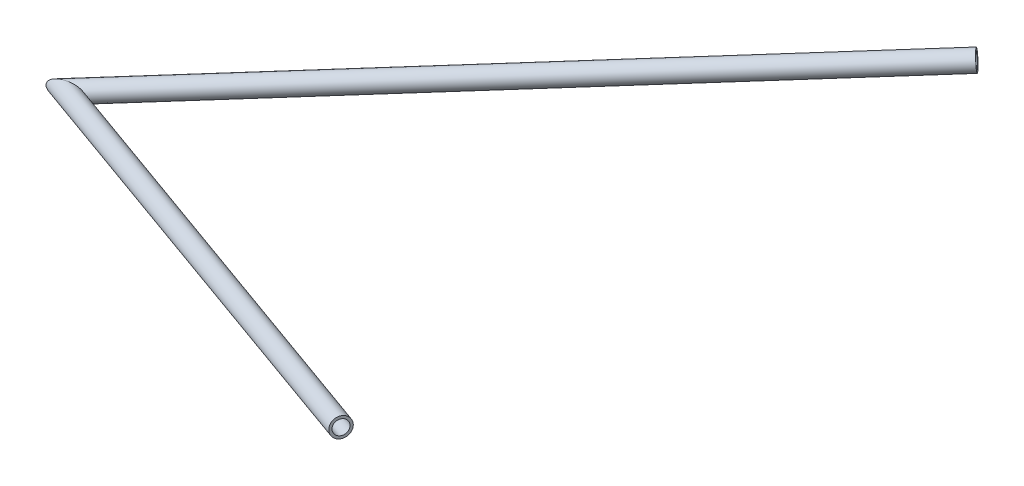
ISO-10303-21;
HEADER;
FILE_DESCRIPTION(('STEP AP214'),'2;1');
FILE_NAME('part.step','',(''),(''),'','','');
FILE_SCHEMA(('AUTOMOTIVE_DESIGN { 1 0 10303 214 1 1 1 1 }'));
ENDSEC;
DATA;
#1=APPLICATION_CONTEXT('core data for automotive mechanical design processes');
#2=APPLICATION_PROTOCOL_DEFINITION('international standard','automotive_design',2000,#1);
#3=PRODUCT_CONTEXT('',#1,'mechanical');
#4=PRODUCT('Part','Part','',(#3));
#5=PRODUCT_RELATED_PRODUCT_CATEGORY('part','',(#4));
#6=PRODUCT_DEFINITION_FORMATION('','',#4);
#7=PRODUCT_DEFINITION_CONTEXT('part definition',#1,'design');
#8=PRODUCT_DEFINITION('design','',#6,#7);
#9=PRODUCT_DEFINITION_SHAPE('','',#8);
#10=(LENGTH_UNIT() NAMED_UNIT(*) SI_UNIT(.MILLI.,.METRE.));
#11=(NAMED_UNIT(*) PLANE_ANGLE_UNIT() SI_UNIT($,.RADIAN.));
#12=(NAMED_UNIT(*) SI_UNIT($,.STERADIAN.) SOLID_ANGLE_UNIT());
#13=UNCERTAINTY_MEASURE_WITH_UNIT(LENGTH_MEASURE(1.E-05),#10,'distance_accuracy_value','');
#14=(GEOMETRIC_REPRESENTATION_CONTEXT(3) GLOBAL_UNCERTAINTY_ASSIGNED_CONTEXT((#13)) GLOBAL_UNIT_ASSIGNED_CONTEXT((#10,
#11,#12)) REPRESENTATION_CONTEXT('',''));
#15=CARTESIAN_POINT('',(0.,0.,0.));
#16=DIRECTION('',(0.,0.,1.));
#17=DIRECTION('',(1.,0.,0.));
#18=AXIS2_PLACEMENT_3D('',#15,#16,#17);
#19=CARTESIAN_POINT('',(-52.0000000000003,-175.4,0.));
#20=DIRECTION('',(0.916236374249616,0.0955745540284936,0.389071216005723));
#21=DIRECTION('',(0.390860467926581,0.,-0.920449941393998));
#22=AXIS2_PLACEMENT_3D('',#19,#20,#21);
#23=CYLINDRICAL_SURFACE('',#22,6.985);
#24=CARTESIAN_POINT('',(435.,-124.600000000004,206.799999999963));
#25=DIRECTION('',(-0.916236374249616,-0.0955745540284936,-0.389071216005723));
#26=DIRECTION('',(-0.393256806295087,0.0289913832751886,0.918971481602329));
#27=AXIS2_PLACEMENT_3D('',#24,#25,#26);
#28=CIRCLE('',#27,6.985);
#29=CARTESIAN_POINT('',(432.253101208029,-124.397495187827,213.219015798956));
#30=VERTEX_POINT('',#29);
#31=EDGE_CURVE('E66',#30,#30,#28,.T.);
#32=ORIENTED_EDGE('',*,*,#31,.F.);
#33=EDGE_LOOP('',(#32));
#34=FACE_BOUND('',#33,.T.);
#35=CARTESIAN_POINT('',(-52.0000000000003,-175.4,0.));
#36=DIRECTION('',(-0.165079115085724,-0.0172197516352238,-0.986129994430823));
#37=DIRECTION('',(0.980808335282266,0.102310191852843,-0.165974799544583));
#38=AXIS2_PLACEMENT_3D('',#35,#36,#37);
#39=ELLIPSE('',#38,13.017822902906,6.985);
#40=CARTESIAN_POINT('',(-39.2320107896017,-174.068144041297,-2.1606305468167));
#41=VERTEX_POINT('',#40);
#42=EDGE_CURVE('E62',#41,#41,#39,.T.);
#43=ORIENTED_EDGE('',*,*,#42,.T.);
#44=EDGE_LOOP('',(#43));
#45=FACE_BOUND('',#44,.T.);
#46=ADVANCED_FACE('F58',(#34,#45),#23,.F.);
#47=CARTESIAN_POINT('',(-52.0000000000003,-175.4,0.));
#48=DIRECTION('',(0.916236374249616,0.0955745540284936,0.389071216005723));
#49=DIRECTION('',(0.390860467926581,0.,-0.920449941393998));
#50=AXIS2_PLACEMENT_3D('',#47,#48,#49);
#51=CYLINDRICAL_SURFACE('',#50,9.525);
#52=CARTESIAN_POINT('',(435.,-124.600000000004,206.799999999963));
#53=DIRECTION('',(-0.916236374249616,-0.0955745540284936,-0.389071216005723));
#54=DIRECTION('',(-0.393256806295087,0.0289913832751886,0.918971481602329));
#55=AXIS2_PLACEMENT_3D('',#52,#53,#54);
#56=CIRCLE('',#55,9.525);
#57=CARTESIAN_POINT('',(431.254228920039,-124.323857074308,215.553203362226));
#58=VERTEX_POINT('',#57);
#59=EDGE_CURVE('E70',#58,#58,#56,.T.);
#60=ORIENTED_EDGE('',*,*,#59,.T.);
#61=EDGE_LOOP('',(#60));
#62=FACE_BOUND('',#61,.T.);
#63=CARTESIAN_POINT('',(-52.0000000000003,-175.4,0.));
#64=DIRECTION('',(-0.165079115085724,-0.0172197516352238,-0.986129994430823));
#65=DIRECTION('',(0.980808335282266,0.102310191852843,-0.165974799544583));
#66=AXIS2_PLACEMENT_3D('',#63,#64,#65);
#67=ELLIPSE('',#66,17.7515766857809,9.525);
#68=CARTESIAN_POINT('',(-34.589105622184,-173.583832783587,-2.94631438202277));
#69=VERTEX_POINT('',#68);
#70=EDGE_CURVE('E12',#69,#69,#67,.T.);
#71=ORIENTED_EDGE('',*,*,#70,.F.);
#72=EDGE_LOOP('',(#71));
#73=FACE_BOUND('',#72,.T.);
#74=ADVANCED_FACE('F85',(#62,#73),#51,.T.);
#75=CARTESIAN_POINT('',(435.,-124.600000000004,206.799999999963));
#76=DIRECTION('',(-0.916236374249616,-0.0955745540284936,-0.389071216005723));
#77=DIRECTION('',(-0.393256806295087,0.0289913832751886,0.918971481602329));
#78=AXIS2_PLACEMENT_3D('',#75,#76,#77);
#79=PLANE('',#78);
#80=ORIENTED_EDGE('',*,*,#31,.T.);
#81=EDGE_LOOP('',(#80));
#82=FACE_BOUND('',#81,.T.);
#83=ORIENTED_EDGE('',*,*,#59,.F.);
#84=EDGE_LOOP('',(#83));
#85=FACE_BOUND('',#84,.T.);
#86=ADVANCED_FACE('F81',(#82,#85),#79,.F.);
#87=CARTESIAN_POINT('',(-52.0000000000003,-175.4,0.));
#88=DIRECTION('',(-0.165079115085724,-0.0172197516352238,-0.986129994430823));
#89=DIRECTION('',(-0.986276230510281,0.,0.165103595146899));
#90=AXIS2_PLACEMENT_3D('',#87,#88,#89);
#91=PLANE('',#90);
#92=ORIENTED_EDGE('',*,*,#42,.F.);
#93=EDGE_LOOP('',(#92));
#94=FACE_BOUND('',#93,.T.);
#95=ORIENTED_EDGE('',*,*,#70,.T.);
#96=EDGE_LOOP('',(#95));
#97=FACE_BOUND('',#96,.T.);
#98=ADVANCED_FACE('F60',(#94,#97),#91,.T.);
#99=CLOSED_SHELL('',(#46,#74,#86,#98));
#100=MANIFOLD_SOLID_BREP('B2',#99);
#101=CARTESIAN_POINT('',(435.,-124.600000000004,-440.944896104356));
#102=DIRECTION('',(-0.739082693872481,-0.0770952789501411,0.669188381236403));
#103=DIRECTION('',(0.67118601210253,0.,0.741288970077056));
#104=AXIS2_PLACEMENT_3D('',#101,#102,#103);
#105=CYLINDRICAL_SURFACE('',#104,6.985);
#106=CARTESIAN_POINT('',(435.,-124.600000000004,-440.944896104356));
#107=DIRECTION('',(0.739082693872481,0.0770952789501411,-0.669188381236403));
#108=DIRECTION('',(-0.67118601210253,0.,-0.741288970077056));
#109=AXIS2_PLACEMENT_3D('',#106,#107,#108);
#110=CIRCLE('',#109,6.985);
#111=CARTESIAN_POINT('',(430.311765705464,-124.600000000004,-446.122799560344));
#112=VERTEX_POINT('',#111);
#113=EDGE_CURVE('E165',#112,#112,#110,.T.);
#114=ORIENTED_EDGE('',*,*,#113,.T.);
#115=EDGE_LOOP('',(#114));
#116=FACE_BOUND('',#115,.T.);
#117=CARTESIAN_POINT('',(-52.0000000000003,-175.4,0.));
#118=DIRECTION('',(0.165079115085724,0.0172197516352238,0.986129994430823));
#119=DIRECTION('',(-0.980808335282266,-0.102310191852843,0.165974799544583));
#120=AXIS2_PLACEMENT_3D('',#117,#118,#119);
#121=ELLIPSE('',#120,13.017822902906,6.985);
#122=CARTESIAN_POINT('',(-64.7679892103989,-176.731855958702,2.1606305468167));
#123=VERTEX_POINT('',#122);
#124=EDGE_CURVE('E153',#123,#123,#121,.T.);
#125=ORIENTED_EDGE('',*,*,#124,.T.);
#126=EDGE_LOOP('',(#125));
#127=FACE_BOUND('',#126,.T.);
#128=ADVANCED_FACE('F149',(#116,#127),#105,.F.);
#129=CARTESIAN_POINT('',(435.,-124.600000000004,-440.944896104356));
#130=DIRECTION('',(-0.739082693872481,-0.0770952789501411,0.669188381236403));
#131=DIRECTION('',(0.67118601210253,0.,0.741288970077056));
#132=AXIS2_PLACEMENT_3D('',#129,#130,#131);
#133=CYLINDRICAL_SURFACE('',#132,9.525);
#134=CARTESIAN_POINT('',(435.,-124.600000000004,-440.944896104356));
#135=DIRECTION('',(0.739082693872481,0.0770952789501411,-0.669188381236403));
#136=DIRECTION('',(-0.67118601210253,0.,-0.741288970077056));
#137=AXIS2_PLACEMENT_3D('',#134,#135,#136);
#138=CIRCLE('',#137,9.525);
#139=CARTESIAN_POINT('',(428.606953234723,-124.600000000004,-448.005673544339));
#140=VERTEX_POINT('',#139);
#141=EDGE_CURVE('E158',#140,#140,#138,.T.);
#142=ORIENTED_EDGE('',*,*,#141,.F.);
#143=EDGE_LOOP('',(#142));
#144=FACE_BOUND('',#143,.T.);
#145=CARTESIAN_POINT('',(-52.0000000000003,-175.4,0.));
#146=DIRECTION('',(0.165079115085724,0.0172197516352238,0.986129994430823));
#147=DIRECTION('',(-0.980808335282266,-0.102310191852843,0.165974799544583));
#148=AXIS2_PLACEMENT_3D('',#145,#146,#147);
#149=ELLIPSE('',#148,17.7515766857809,9.525);
#150=CARTESIAN_POINT('',(-69.4108943778166,-177.216167216412,2.94631438202277));
#151=VERTEX_POINT('',#150);
#152=EDGE_CURVE('E57',#151,#151,#149,.T.);
#153=ORIENTED_EDGE('',*,*,#152,.F.);
#154=EDGE_LOOP('',(#153));
#155=FACE_BOUND('',#154,.T.);
#156=ADVANCED_FACE('F180',(#144,#155),#133,.T.);
#157=CARTESIAN_POINT('',(435.,-124.600000000004,-440.944896104356));
#158=DIRECTION('',(0.739082693872481,0.0770952789501411,-0.669188381236403));
#159=DIRECTION('',(-0.67118601210253,0.,-0.741288970077056));
#160=AXIS2_PLACEMENT_3D('',#157,#158,#159);
#161=PLANE('',#160);
#162=ORIENTED_EDGE('',*,*,#113,.F.);
#163=EDGE_LOOP('',(#162));
#164=FACE_BOUND('',#163,.T.);
#165=ORIENTED_EDGE('',*,*,#141,.T.);
#166=EDGE_LOOP('',(#165));
#167=FACE_BOUND('',#166,.T.);
#168=ADVANCED_FACE('F176',(#164,#167),#161,.T.);
#169=CARTESIAN_POINT('',(-52.0000000000003,-175.4,0.));
#170=DIRECTION('',(0.165079115085724,0.0172197516352238,0.986129994430823));
#171=DIRECTION('',(0.986276230510281,0.,-0.165103595146899));
#172=AXIS2_PLACEMENT_3D('',#169,#170,#171);
#173=PLANE('',#172);
#174=ORIENTED_EDGE('',*,*,#124,.F.);
#175=EDGE_LOOP('',(#174));
#176=FACE_BOUND('',#175,.T.);
#177=ORIENTED_EDGE('',*,*,#152,.T.);
#178=EDGE_LOOP('',(#177));
#179=FACE_BOUND('',#178,.T.);
#180=ADVANCED_FACE('F151',(#176,#179),#173,.T.);
#181=CLOSED_SHELL('',(#128,#156,#168,#180));
#182=MANIFOLD_SOLID_BREP('B7',#181);
#183=ADVANCED_BREP_SHAPE_REPRESENTATION('',(#18,#100,#182),#14);
#184=SHAPE_DEFINITION_REPRESENTATION(#9,#183);
ENDSEC;
END-ISO-10303-21;
